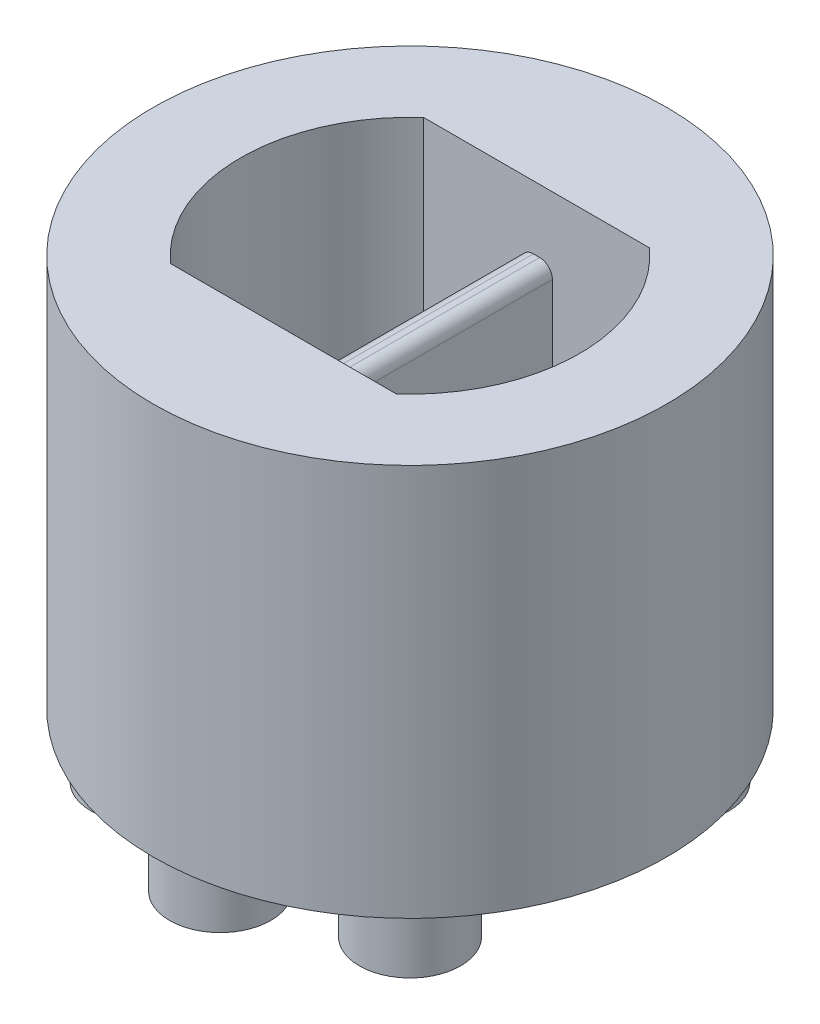
ISO-10303-21;
HEADER;
FILE_DESCRIPTION(('STEP AP214'),'2;1');
FILE_NAME('part.step','',(''),(''),'','','');
FILE_SCHEMA(('AUTOMOTIVE_DESIGN { 1 0 10303 214 1 1 1 1 }'));
ENDSEC;
DATA;
#1=APPLICATION_CONTEXT('core data for automotive mechanical design processes');
#2=APPLICATION_PROTOCOL_DEFINITION('international standard','automotive_design',2000,#1);
#3=PRODUCT_CONTEXT('',#1,'mechanical');
#4=PRODUCT('Part','Part','',(#3));
#5=PRODUCT_RELATED_PRODUCT_CATEGORY('part','',(#4));
#6=PRODUCT_DEFINITION_FORMATION('','',#4);
#7=PRODUCT_DEFINITION_CONTEXT('part definition',#1,'design');
#8=PRODUCT_DEFINITION('design','',#6,#7);
#9=PRODUCT_DEFINITION_SHAPE('','',#8);
#10=(LENGTH_UNIT() NAMED_UNIT(*) SI_UNIT(.MILLI.,.METRE.));
#11=(NAMED_UNIT(*) PLANE_ANGLE_UNIT() SI_UNIT($,.RADIAN.));
#12=(NAMED_UNIT(*) SI_UNIT($,.STERADIAN.) SOLID_ANGLE_UNIT());
#13=UNCERTAINTY_MEASURE_WITH_UNIT(LENGTH_MEASURE(1.E-05),#10,'distance_accuracy_value','');
#14=(GEOMETRIC_REPRESENTATION_CONTEXT(3) GLOBAL_UNCERTAINTY_ASSIGNED_CONTEXT((#13)) GLOBAL_UNIT_ASSIGNED_CONTEXT((#10,
#11,#12)) REPRESENTATION_CONTEXT('',''));
#15=CARTESIAN_POINT('',(0.,0.,0.));
#16=DIRECTION('',(0.,0.,1.));
#17=DIRECTION('',(1.,0.,0.));
#18=AXIS2_PLACEMENT_3D('',#15,#16,#17);
#19=CARTESIAN_POINT('',(0.158749999999999,3.302,-1.27));
#20=DIRECTION('',(0.,-1.,0.));
#21=DIRECTION('',(0.,0.,-1.));
#22=AXIS2_PLACEMENT_3D('',#19,#20,#21);
#23=PLANE('',#22);
#24=DIRECTION('',(0.,0.,1.));
#25=VECTOR('',#24,1.);
#26=CARTESIAN_POINT('',(-0.0317499999999965,3.302,-1.27));
#27=LINE('',#26,#25);
#28=CARTESIAN_POINT('',(-0.0317500000000008,3.302,1.27000000000001));
#29=VERTEX_POINT('',#28);
#30=CARTESIAN_POINT('',(-0.0317500000000002,3.302,-1.27));
#31=VERTEX_POINT('',#30);
#32=EDGE_CURVE('E99',#29,#31,#27,.F.);
#33=ORIENTED_EDGE('',*,*,#32,.F.);
#34=DIRECTION('',(1.,0.,0.));
#35=VECTOR('',#34,1.);
#36=CARTESIAN_POINT('',(0.158749999999999,3.302,1.27000000000001));
#37=LINE('',#36,#35);
#38=CARTESIAN_POINT('',(0.0317499999999965,3.302,1.27000000000001));
#39=VERTEX_POINT('',#38);
#40=EDGE_CURVE('E104',#39,#29,#37,.F.);
#41=ORIENTED_EDGE('',*,*,#40,.F.);
#42=DIRECTION('',(0.,0.,-1.));
#43=VECTOR('',#42,1.);
#44=CARTESIAN_POINT('',(0.0317499999999971,3.302,-1.26999999999999));
#45=LINE('',#44,#43);
#46=CARTESIAN_POINT('',(0.0317499999999971,3.302,-1.27));
#47=VERTEX_POINT('',#46);
#48=EDGE_CURVE('E102',#47,#39,#45,.F.);
#49=ORIENTED_EDGE('',*,*,#48,.F.);
#50=DIRECTION('',(1.,0.,0.));
#51=VECTOR('',#50,1.);
#52=CARTESIAN_POINT('',(0.158749999999999,3.302,-1.27));
#53=LINE('',#52,#51);
#54=EDGE_CURVE('E86',#31,#47,#53,.T.);
#55=ORIENTED_EDGE('',*,*,#54,.F.);
#56=EDGE_LOOP('',(#33,#41,#49,#55));
#57=FACE_BOUND('',#56,.T.);
#58=ADVANCED_FACE('F16',(#57),#23,.F.);
#59=CARTESIAN_POINT('',(-0.031750000000004,3.175,-1.27));
#60=DIRECTION('',(0.,0.,1.));
#61=DIRECTION('',(1.,0.,0.));
#62=AXIS2_PLACEMENT_3D('',#59,#60,#61);
#63=CYLINDRICAL_SURFACE('',#62,0.127);
#64=CARTESIAN_POINT('',(-0.0317500000000046,3.175,1.27));
#65=DIRECTION('',(0.,0.,1.));
#66=DIRECTION('',(1.,0.,0.));
#67=AXIS2_PLACEMENT_3D('',#64,#65,#66);
#68=CIRCLE('',#67,0.127);
#69=CARTESIAN_POINT('',(-0.158749999999999,3.175,1.27000000000001));
#70=VERTEX_POINT('',#69);
#71=EDGE_CURVE('E95',#70,#29,#68,.F.);
#72=ORIENTED_EDGE('',*,*,#71,.T.);
#73=ORIENTED_EDGE('',*,*,#32,.T.);
#74=CARTESIAN_POINT('',(-0.031750000000004,3.175,-1.27));
#75=DIRECTION('',(0.,0.,1.));
#76=DIRECTION('',(1.,0.,0.));
#77=AXIS2_PLACEMENT_3D('',#74,#75,#76);
#78=CIRCLE('',#77,0.127);
#79=CARTESIAN_POINT('',(-0.158749999999999,3.175,-1.27));
#80=VERTEX_POINT('',#79);
#81=EDGE_CURVE('E19',#31,#80,#78,.T.);
#82=ORIENTED_EDGE('',*,*,#81,.T.);
#83=DIRECTION('',(0.,0.,-1.));
#84=VECTOR('',#83,1.);
#85=CARTESIAN_POINT('',(-0.158749999999999,3.175,1.27));
#86=LINE('',#85,#84);
#87=EDGE_CURVE('E181',#80,#70,#86,.F.);
#88=ORIENTED_EDGE('',*,*,#87,.T.);
#89=EDGE_LOOP('',(#72,#73,#82,#88));
#90=FACE_BOUND('',#89,.T.);
#91=ADVANCED_FACE('F106',(#90),#63,.T.);
#92=CARTESIAN_POINT('',(0.0317499999999971,3.175,-1.26999999999999));
#93=DIRECTION('',(0.,0.,-1.));
#94=DIRECTION('',(-1.,0.,0.));
#95=AXIS2_PLACEMENT_3D('',#92,#93,#94);
#96=CYLINDRICAL_SURFACE('',#95,0.127);
#97=CARTESIAN_POINT('',(0.0317499999999971,3.175,-1.27));
#98=DIRECTION('',(0.,0.,-1.));
#99=DIRECTION('',(-1.,0.,0.));
#100=AXIS2_PLACEMENT_3D('',#97,#98,#99);
#101=CIRCLE('',#100,0.127);
#102=CARTESIAN_POINT('',(0.158749999999999,3.175,-1.27));
#103=VERTEX_POINT('',#102);
#104=EDGE_CURVE('E109',#103,#47,#101,.F.);
#105=ORIENTED_EDGE('',*,*,#104,.T.);
#106=ORIENTED_EDGE('',*,*,#48,.T.);
#107=CARTESIAN_POINT('',(0.0317499999999965,3.175,1.27000000000001));
#108=DIRECTION('',(0.,0.,-1.));
#109=DIRECTION('',(-1.,0.,0.));
#110=AXIS2_PLACEMENT_3D('',#107,#108,#109);
#111=CIRCLE('',#110,0.127);
#112=CARTESIAN_POINT('',(0.158749999999999,3.175,1.27000000000001));
#113=VERTEX_POINT('',#112);
#114=EDGE_CURVE('E107',#39,#113,#111,.T.);
#115=ORIENTED_EDGE('',*,*,#114,.T.);
#116=DIRECTION('',(0.,0.,1.));
#117=VECTOR('',#116,1.);
#118=CARTESIAN_POINT('',(0.158749999999999,3.175,1.27));
#119=LINE('',#118,#117);
#120=EDGE_CURVE('E183',#113,#103,#119,.F.);
#121=ORIENTED_EDGE('',*,*,#120,.T.);
#122=EDGE_LOOP('',(#105,#106,#115,#121));
#123=FACE_BOUND('',#122,.T.);
#124=ADVANCED_FACE('F338',(#123),#96,.T.);
#125=CARTESIAN_POINT('',(-0.158749999999999,3.302,1.27));
#126=DIRECTION('',(1.,0.,0.));
#127=DIRECTION('',(0.,0.,-1.));
#128=AXIS2_PLACEMENT_3D('',#125,#126,#127);
#129=PLANE('',#128);
#130=ORIENTED_EDGE('',*,*,#87,.F.);
#131=DIRECTION('',(0.,1.,0.));
#132=VECTOR('',#131,1.);
#133=CARTESIAN_POINT('',(-0.158749999999999,0.508,-1.27));
#134=LINE('',#133,#132);
#135=CARTESIAN_POINT('',(-0.158749999999999,0.508,-1.27));
#136=VERTEX_POINT('',#135);
#137=EDGE_CURVE('E90',#80,#136,#134,.F.);
#138=ORIENTED_EDGE('',*,*,#137,.T.);
#139=DIRECTION('',(0.,0.,1.));
#140=VECTOR('',#139,1.);
#141=CARTESIAN_POINT('',(-0.158749999999999,0.508,0.));
#142=LINE('',#141,#140);
#143=CARTESIAN_POINT('',(-0.158749999999999,0.508,1.27000000000001));
#144=VERTEX_POINT('',#143);
#145=EDGE_CURVE('E178',#144,#136,#142,.F.);
#146=ORIENTED_EDGE('',*,*,#145,.F.);
#147=DIRECTION('',(0.,1.,0.));
#148=VECTOR('',#147,1.);
#149=CARTESIAN_POINT('',(-0.158749999999999,0.508,1.27000000000001));
#150=LINE('',#149,#148);
#151=EDGE_CURVE('E209',#144,#70,#150,.T.);
#152=ORIENTED_EDGE('',*,*,#151,.T.);
#153=EDGE_LOOP('',(#130,#138,#146,#152));
#154=FACE_BOUND('',#153,.T.);
#155=ADVANCED_FACE('F331',(#154),#129,.F.);
#156=CARTESIAN_POINT('',(0.158749999999999,3.302,1.27));
#157=DIRECTION('',(-1.,0.,0.));
#158=DIRECTION('',(0.,0.,1.));
#159=AXIS2_PLACEMENT_3D('',#156,#157,#158);
#160=PLANE('',#159);
#161=ORIENTED_EDGE('',*,*,#120,.F.);
#162=DIRECTION('',(0.,1.,0.));
#163=VECTOR('',#162,1.);
#164=CARTESIAN_POINT('',(0.158749999999999,0.508,1.27000000000001));
#165=LINE('',#164,#163);
#166=CARTESIAN_POINT('',(0.158749999999999,0.508,1.27000000000001));
#167=VERTEX_POINT('',#166);
#168=EDGE_CURVE('E171',#113,#167,#165,.F.);
#169=ORIENTED_EDGE('',*,*,#168,.T.);
#170=DIRECTION('',(0.,0.,1.));
#171=VECTOR('',#170,1.);
#172=CARTESIAN_POINT('',(0.158749999999999,0.508,0.));
#173=LINE('',#172,#171);
#174=CARTESIAN_POINT('',(0.158749999999999,0.508,-1.27));
#175=VERTEX_POINT('',#174);
#176=EDGE_CURVE('E198',#175,#167,#173,.T.);
#177=ORIENTED_EDGE('',*,*,#176,.F.);
#178=DIRECTION('',(0.,1.,0.));
#179=VECTOR('',#178,1.);
#180=CARTESIAN_POINT('',(0.158749999999999,0.508,-1.27));
#181=LINE('',#180,#179);
#182=EDGE_CURVE('E175',#175,#103,#181,.T.);
#183=ORIENTED_EDGE('',*,*,#182,.T.);
#184=EDGE_LOOP('',(#161,#169,#177,#183));
#185=FACE_BOUND('',#184,.T.);
#186=ADVANCED_FACE('F321',(#185),#160,.F.);
#187=CARTESIAN_POINT('',(0.,0.508,0.));
#188=DIRECTION('',(0.,1.,0.));
#189=DIRECTION('',(0.,0.,1.));
#190=AXIS2_PLACEMENT_3D('',#187,#188,#189);
#191=PLANE('',#190);
#192=DIRECTION('',(1.,0.,0.));
#193=VECTOR('',#192,1.);
#194=CARTESIAN_POINT('',(-1.13279443854567,0.508,1.27000000000001));
#195=LINE('',#194,#193);
#196=CARTESIAN_POINT('',(1.13279443854567,0.508,1.27000000000001));
#197=VERTEX_POINT('',#196);
#198=EDGE_CURVE('E214',#167,#197,#195,.T.);
#199=ORIENTED_EDGE('',*,*,#198,.T.);
#200=CARTESIAN_POINT('',(0.,0.508,0.));
#201=DIRECTION('',(0.,1.,0.));
#202=DIRECTION('',(0.,0.,1.));
#203=AXIS2_PLACEMENT_3D('',#200,#201,#202);
#204=CIRCLE('',#203,1.7018);
#205=CARTESIAN_POINT('',(1.13279443854567,0.508,-1.27));
#206=VERTEX_POINT('',#205);
#207=EDGE_CURVE('E172',#197,#206,#204,.T.);
#208=ORIENTED_EDGE('',*,*,#207,.T.);
#209=DIRECTION('',(-1.,0.,0.));
#210=VECTOR('',#209,1.);
#211=CARTESIAN_POINT('',(-1.13279443854567,0.508,-1.27));
#212=LINE('',#211,#210);
#213=EDGE_CURVE('E193',#206,#175,#212,.T.);
#214=ORIENTED_EDGE('',*,*,#213,.T.);
#215=ORIENTED_EDGE('',*,*,#176,.T.);
#216=EDGE_LOOP('',(#199,#208,#214,#215));
#217=FACE_BOUND('',#216,.T.);
#218=CARTESIAN_POINT('',(1.27,0.508,0.));
#219=DIRECTION('',(0.,1.,0.));
#220=DIRECTION('',(0.,0.,1.));
#221=AXIS2_PLACEMENT_3D('',#218,#219,#220);
#222=CIRCLE('',#221,0.3175);
#223=CARTESIAN_POINT('',(1.27,0.508,0.3175));
#224=VERTEX_POINT('',#223);
#225=EDGE_CURVE('E168',#224,#224,#222,.F.);
#226=ORIENTED_EDGE('',*,*,#225,.T.);
#227=EDGE_LOOP('',(#226));
#228=FACE_BOUND('',#227,.T.);
#229=ADVANCED_FACE('F318',(#217,#228),#191,.T.);
#230=CARTESIAN_POINT('',(0.,0.508,0.));
#231=DIRECTION('',(0.,1.,0.));
#232=DIRECTION('',(0.,0.,1.));
#233=AXIS2_PLACEMENT_3D('',#230,#231,#232);
#234=PLANE('',#233);
#235=DIRECTION('',(-1.,0.,0.));
#236=VECTOR('',#235,1.);
#237=CARTESIAN_POINT('',(-1.13279443854567,0.508,-1.27));
#238=LINE('',#237,#236);
#239=CARTESIAN_POINT('',(-1.13279443854567,0.508,-1.27));
#240=VERTEX_POINT('',#239);
#241=EDGE_CURVE('E188',#136,#240,#238,.T.);
#242=ORIENTED_EDGE('',*,*,#241,.T.);
#243=CARTESIAN_POINT('',(0.,0.508,0.));
#244=DIRECTION('',(0.,1.,0.));
#245=DIRECTION('',(0.,0.,1.));
#246=AXIS2_PLACEMENT_3D('',#243,#244,#245);
#247=CIRCLE('',#246,1.7018);
#248=CARTESIAN_POINT('',(-1.13279443854567,0.508,1.27000000000001));
#249=VERTEX_POINT('',#248);
#250=EDGE_CURVE('E176',#240,#249,#247,.T.);
#251=ORIENTED_EDGE('',*,*,#250,.T.);
#252=DIRECTION('',(1.,0.,0.));
#253=VECTOR('',#252,1.);
#254=CARTESIAN_POINT('',(-1.13279443854567,0.508,1.27000000000001));
#255=LINE('',#254,#253);
#256=EDGE_CURVE('E207',#249,#144,#255,.T.);
#257=ORIENTED_EDGE('',*,*,#256,.T.);
#258=ORIENTED_EDGE('',*,*,#145,.T.);
#259=EDGE_LOOP('',(#242,#251,#257,#258));
#260=FACE_BOUND('',#259,.T.);
#261=CARTESIAN_POINT('',(-1.27,0.508,0.));
#262=DIRECTION('',(0.,1.,0.));
#263=DIRECTION('',(0.,0.,1.));
#264=AXIS2_PLACEMENT_3D('',#261,#262,#263);
#265=CIRCLE('',#264,0.3175);
#266=CARTESIAN_POINT('',(-1.27,0.508,0.317500000000007));
#267=VERTEX_POINT('',#266);
#268=EDGE_CURVE('E165',#267,#267,#265,.F.);
#269=ORIENTED_EDGE('',*,*,#268,.T.);
#270=EDGE_LOOP('',(#269));
#271=FACE_BOUND('',#270,.T.);
#272=ADVANCED_FACE('F320',(#260,#271),#234,.T.);
#273=CARTESIAN_POINT('',(-1.34703841816038,-0.635,-1.34703841816036));
#274=DIRECTION('',(0.,-1.,0.));
#275=DIRECTION('',(0.,0.,-1.));
#276=AXIS2_PLACEMENT_3D('',#273,#274,#275);
#277=PLANE('',#276);
#278=CARTESIAN_POINT('',(-1.34703841816038,-0.635,-1.34703841816036));
#279=DIRECTION('',(0.,1.,0.));
#280=DIRECTION('',(0.,0.,1.));
#281=AXIS2_PLACEMENT_3D('',#278,#279,#280);
#282=CIRCLE('',#281,0.508);
#283=CARTESIAN_POINT('',(-1.34703841816038,-0.635,-0.839038418160355));
#284=VERTEX_POINT('',#283);
#285=EDGE_CURVE('E162',#284,#284,#282,.T.);
#286=ORIENTED_EDGE('',*,*,#285,.F.);
#287=EDGE_LOOP('',(#286));
#288=FACE_BOUND('',#287,.T.);
#289=ADVANCED_FACE('F328',(#288),#277,.T.);
#290=CARTESIAN_POINT('',(1.34703841816035,-0.635,-1.34703841816033));
#291=DIRECTION('',(0.,-1.,0.));
#292=DIRECTION('',(0.,0.,-1.));
#293=AXIS2_PLACEMENT_3D('',#290,#291,#292);
#294=PLANE('',#293);
#295=CARTESIAN_POINT('',(1.34703841816035,-0.635,-1.34703841816033));
#296=DIRECTION('',(0.,1.,0.));
#297=DIRECTION('',(0.,0.,1.));
#298=AXIS2_PLACEMENT_3D('',#295,#296,#297);
#299=CIRCLE('',#298,0.508000000000026);
#300=CARTESIAN_POINT('',(1.34703841816035,-0.635,-0.839038418160308));
#301=VERTEX_POINT('',#300);
#302=EDGE_CURVE('E159',#301,#301,#299,.T.);
#303=ORIENTED_EDGE('',*,*,#302,.F.);
#304=EDGE_LOOP('',(#303));
#305=FACE_BOUND('',#304,.T.);
#306=ADVANCED_FACE('F398',(#305),#294,.T.);
#307=CARTESIAN_POINT('',(0.,-0.635,1.905));
#308=DIRECTION('',(0.,-1.,0.));
#309=DIRECTION('',(0.,0.,-1.));
#310=AXIS2_PLACEMENT_3D('',#307,#308,#309);
#311=PLANE('',#310);
#312=CARTESIAN_POINT('',(0.,-0.635,1.905));
#313=DIRECTION('',(0.,1.,0.));
#314=DIRECTION('',(0.,0.,1.));
#315=AXIS2_PLACEMENT_3D('',#312,#313,#314);
#316=CIRCLE('',#315,0.508000000000001);
#317=CARTESIAN_POINT('',(0.,-0.635,2.413));
#318=VERTEX_POINT('',#317);
#319=EDGE_CURVE('E156',#318,#318,#316,.T.);
#320=ORIENTED_EDGE('',*,*,#319,.F.);
#321=EDGE_LOOP('',(#320));
#322=FACE_BOUND('',#321,.T.);
#323=ADVANCED_FACE('F407',(#322),#311,.T.);
#324=CARTESIAN_POINT('',(1.34703841816038,-0.635,1.34703841816037));
#325=DIRECTION('',(0.,-1.,0.));
#326=DIRECTION('',(0.,0.,-1.));
#327=AXIS2_PLACEMENT_3D('',#324,#325,#326);
#328=PLANE('',#327);
#329=CARTESIAN_POINT('',(1.34703841816038,-0.635,1.34703841816037));
#330=DIRECTION('',(0.,1.,0.));
#331=DIRECTION('',(0.,0.,1.));
#332=AXIS2_PLACEMENT_3D('',#329,#330,#331);
#333=CIRCLE('',#332,0.508);
#334=CARTESIAN_POINT('',(1.34703841816038,-0.635,1.85503841816037));
#335=VERTEX_POINT('',#334);
#336=EDGE_CURVE('E153',#335,#335,#333,.T.);
#337=ORIENTED_EDGE('',*,*,#336,.F.);
#338=EDGE_LOOP('',(#337));
#339=FACE_BOUND('',#338,.T.);
#340=ADVANCED_FACE('F417',(#339),#328,.T.);
#341=CARTESIAN_POINT('',(0.,-0.635,-1.90499999999994));
#342=DIRECTION('',(0.,-1.,0.));
#343=DIRECTION('',(0.,0.,-1.));
#344=AXIS2_PLACEMENT_3D('',#341,#342,#343);
#345=PLANE('',#344);
#346=CARTESIAN_POINT('',(0.,-0.635,-1.90499999999994));
#347=DIRECTION('',(0.,1.,0.));
#348=DIRECTION('',(0.,0.,1.));
#349=AXIS2_PLACEMENT_3D('',#346,#347,#348);
#350=CIRCLE('',#349,0.508000000000008);
#351=CARTESIAN_POINT('',(0.,-0.635,-1.39699999999994));
#352=VERTEX_POINT('',#351);
#353=EDGE_CURVE('E150',#352,#352,#350,.T.);
#354=ORIENTED_EDGE('',*,*,#353,.F.);
#355=EDGE_LOOP('',(#354));
#356=FACE_BOUND('',#355,.T.);
#357=ADVANCED_FACE('F427',(#356),#345,.T.);
#358=CARTESIAN_POINT('',(-1.34703841816036,-0.635,1.3470384181604));
#359=DIRECTION('',(0.,-1.,0.));
#360=DIRECTION('',(0.,0.,-1.));
#361=AXIS2_PLACEMENT_3D('',#358,#359,#360);
#362=PLANE('',#361);
#363=CARTESIAN_POINT('',(-1.34703841816036,-0.635,1.3470384181604));
#364=DIRECTION('',(0.,1.,0.));
#365=DIRECTION('',(0.,0.,1.));
#366=AXIS2_PLACEMENT_3D('',#363,#364,#365);
#367=CIRCLE('',#366,0.508000000000001);
#368=CARTESIAN_POINT('',(-1.34703841816036,-0.635,1.8550384181604));
#369=VERTEX_POINT('',#368);
#370=EDGE_CURVE('E147',#369,#369,#367,.T.);
#371=ORIENTED_EDGE('',*,*,#370,.F.);
#372=EDGE_LOOP('',(#371));
#373=FACE_BOUND('',#372,.T.);
#374=ADVANCED_FACE('F437',(#373),#362,.T.);
#375=CARTESIAN_POINT('',(0.,0.508,0.));
#376=DIRECTION('',(0.,1.,0.));
#377=DIRECTION('',(0.,0.,1.));
#378=AXIS2_PLACEMENT_3D('',#375,#376,#377);
#379=CYLINDRICAL_SURFACE('',#378,1.7018);
#380=DIRECTION('',(0.,1.,0.));
#381=VECTOR('',#380,1.);
#382=CARTESIAN_POINT('',(-1.13279443854567,0.508,1.27000000000001));
#383=LINE('',#382,#381);
#384=CARTESIAN_POINT('',(-1.13279443854567,3.937,1.27000000000001));
#385=VERTEX_POINT('',#384);
#386=EDGE_CURVE('E210',#385,#249,#383,.F.);
#387=ORIENTED_EDGE('',*,*,#386,.T.);
#388=ORIENTED_EDGE('',*,*,#250,.F.);
#389=DIRECTION('',(0.,1.,0.));
#390=VECTOR('',#389,1.);
#391=CARTESIAN_POINT('',(-1.13279443854567,0.508,-1.27));
#392=LINE('',#391,#390);
#393=CARTESIAN_POINT('',(-1.13279443854567,3.937,-1.27));
#394=VERTEX_POINT('',#393);
#395=EDGE_CURVE('E190',#240,#394,#392,.T.);
#396=ORIENTED_EDGE('',*,*,#395,.T.);
#397=CARTESIAN_POINT('',(0.,3.937,0.));
#398=DIRECTION('',(0.,1.,0.));
#399=DIRECTION('',(0.,0.,1.));
#400=AXIS2_PLACEMENT_3D('',#397,#398,#399);
#401=CIRCLE('',#400,1.7018);
#402=EDGE_CURVE('E144',#385,#394,#401,.F.);
#403=ORIENTED_EDGE('',*,*,#402,.F.);
#404=EDGE_LOOP('',(#387,#388,#396,#403));
#405=FACE_BOUND('',#404,.T.);
#406=ADVANCED_FACE('F250',(#405),#379,.F.);
#407=CARTESIAN_POINT('',(-1.13279443854567,0.508,-1.27));
#408=DIRECTION('',(0.,0.,-1.));
#409=DIRECTION('',(-1.,0.,0.));
#410=AXIS2_PLACEMENT_3D('',#407,#408,#409);
#411=PLANE('',#410);
#412=ORIENTED_EDGE('',*,*,#104,.F.);
#413=ORIENTED_EDGE('',*,*,#182,.F.);
#414=ORIENTED_EDGE('',*,*,#213,.F.);
#415=DIRECTION('',(0.,1.,0.));
#416=VECTOR('',#415,1.);
#417=CARTESIAN_POINT('',(1.13279443854567,0.508,-1.27));
#418=LINE('',#417,#416);
#419=CARTESIAN_POINT('',(1.13279443854567,3.937,-1.27));
#420=VERTEX_POINT('',#419);
#421=EDGE_CURVE('E174',#206,#420,#418,.T.);
#422=ORIENTED_EDGE('',*,*,#421,.T.);
#423=DIRECTION('',(1.,0.,0.));
#424=VECTOR('',#423,1.);
#425=CARTESIAN_POINT('',(0.,3.937,-1.27));
#426=LINE('',#425,#424);
#427=EDGE_CURVE('E143',#394,#420,#426,.T.);
#428=ORIENTED_EDGE('',*,*,#427,.F.);
#429=ORIENTED_EDGE('',*,*,#395,.F.);
#430=ORIENTED_EDGE('',*,*,#241,.F.);
#431=ORIENTED_EDGE('',*,*,#137,.F.);
#432=ORIENTED_EDGE('',*,*,#81,.F.);
#433=ORIENTED_EDGE('',*,*,#54,.T.);
#434=EDGE_LOOP('',(#412,#413,#414,#422,#428,#429,#430,#431,#432,#433));
#435=FACE_BOUND('',#434,.T.);
#436=ADVANCED_FACE('F85',(#435),#411,.F.);
#437=CARTESIAN_POINT('',(0.,0.508,0.));
#438=DIRECTION('',(0.,1.,0.));
#439=DIRECTION('',(0.,0.,1.));
#440=AXIS2_PLACEMENT_3D('',#437,#438,#439);
#441=CYLINDRICAL_SURFACE('',#440,1.7018);
#442=ORIENTED_EDGE('',*,*,#421,.F.);
#443=ORIENTED_EDGE('',*,*,#207,.F.);
#444=DIRECTION('',(0.,1.,0.));
#445=VECTOR('',#444,1.);
#446=CARTESIAN_POINT('',(1.13279443854567,0.508,1.27000000000001));
#447=LINE('',#446,#445);
#448=CARTESIAN_POINT('',(1.13279443854567,3.937,1.27000000000001));
#449=VERTEX_POINT('',#448);
#450=EDGE_CURVE('E34',#197,#449,#447,.T.);
#451=ORIENTED_EDGE('',*,*,#450,.T.);
#452=CARTESIAN_POINT('',(0.,3.937,0.));
#453=DIRECTION('',(0.,1.,0.));
#454=DIRECTION('',(0.,0.,1.));
#455=AXIS2_PLACEMENT_3D('',#452,#453,#454);
#456=CIRCLE('',#455,1.7018);
#457=EDGE_CURVE('E140',#420,#449,#456,.F.);
#458=ORIENTED_EDGE('',*,*,#457,.F.);
#459=EDGE_LOOP('',(#442,#443,#451,#458));
#460=FACE_BOUND('',#459,.T.);
#461=ADVANCED_FACE('F256',(#460),#441,.F.);
#462=CARTESIAN_POINT('',(-1.13279443854567,0.508,1.27000000000001));
#463=DIRECTION('',(0.,0.,1.));
#464=DIRECTION('',(1.,0.,0.));
#465=AXIS2_PLACEMENT_3D('',#462,#463,#464);
#466=PLANE('',#465);
#467=ORIENTED_EDGE('',*,*,#114,.F.);
#468=ORIENTED_EDGE('',*,*,#40,.T.);
#469=ORIENTED_EDGE('',*,*,#71,.F.);
#470=ORIENTED_EDGE('',*,*,#151,.F.);
#471=ORIENTED_EDGE('',*,*,#256,.F.);
#472=ORIENTED_EDGE('',*,*,#386,.F.);
#473=DIRECTION('',(1.,0.,0.));
#474=VECTOR('',#473,1.);
#475=CARTESIAN_POINT('',(0.,3.937,1.27));
#476=LINE('',#475,#474);
#477=EDGE_CURVE('E139',#449,#385,#476,.F.);
#478=ORIENTED_EDGE('',*,*,#477,.F.);
#479=ORIENTED_EDGE('',*,*,#450,.F.);
#480=ORIENTED_EDGE('',*,*,#198,.F.);
#481=ORIENTED_EDGE('',*,*,#168,.F.);
#482=EDGE_LOOP('',(#467,#468,#469,#470,#471,#472,#478,#479,#480,#481));
#483=FACE_BOUND('',#482,.T.);
#484=ADVANCED_FACE('F244',(#483),#466,.F.);
#485=CARTESIAN_POINT('',(1.27,-0.635,0.));
#486=DIRECTION('',(0.,1.,0.));
#487=DIRECTION('',(0.,0.,1.));
#488=AXIS2_PLACEMENT_3D('',#485,#486,#487);
#489=CYLINDRICAL_SURFACE('',#488,0.3175);
#490=CARTESIAN_POINT('',(1.27,0.,0.));
#491=DIRECTION('',(0.,1.,0.));
#492=DIRECTION('',(0.,0.,1.));
#493=AXIS2_PLACEMENT_3D('',#490,#491,#492);
#494=CIRCLE('',#493,0.3175);
#495=CARTESIAN_POINT('',(1.27,0.,0.3175));
#496=VERTEX_POINT('',#495);
#497=EDGE_CURVE('E136',#496,#496,#494,.F.);
#498=ORIENTED_EDGE('',*,*,#497,.T.);
#499=EDGE_LOOP('',(#498));
#500=FACE_BOUND('',#499,.T.);
#501=ORIENTED_EDGE('',*,*,#225,.F.);
#502=EDGE_LOOP('',(#501));
#503=FACE_BOUND('',#502,.T.);
#504=ADVANCED_FACE('F264',(#500,#503),#489,.F.);
#505=CARTESIAN_POINT('',(-1.27,-0.635,0.));
#506=DIRECTION('',(0.,1.,0.));
#507=DIRECTION('',(0.,0.,1.));
#508=AXIS2_PLACEMENT_3D('',#505,#506,#507);
#509=CYLINDRICAL_SURFACE('',#508,0.3175);
#510=CARTESIAN_POINT('',(-1.27,0.,0.));
#511=DIRECTION('',(0.,1.,0.));
#512=DIRECTION('',(0.,0.,1.));
#513=AXIS2_PLACEMENT_3D('',#510,#511,#512);
#514=CIRCLE('',#513,0.3175);
#515=CARTESIAN_POINT('',(-1.27,0.,0.317500000000007));
#516=VERTEX_POINT('',#515);
#517=EDGE_CURVE('E133',#516,#516,#514,.F.);
#518=ORIENTED_EDGE('',*,*,#517,.T.);
#519=EDGE_LOOP('',(#518));
#520=FACE_BOUND('',#519,.T.);
#521=ORIENTED_EDGE('',*,*,#268,.F.);
#522=EDGE_LOOP('',(#521));
#523=FACE_BOUND('',#522,.T.);
#524=ADVANCED_FACE('F305',(#520,#523),#509,.F.);
#525=CARTESIAN_POINT('',(-1.34703841816038,-0.635,-1.34703841816036));
#526=DIRECTION('',(0.,1.,0.));
#527=DIRECTION('',(0.,0.,1.));
#528=AXIS2_PLACEMENT_3D('',#525,#526,#527);
#529=CYLINDRICAL_SURFACE('',#528,0.508);
#530=ORIENTED_EDGE('',*,*,#285,.T.);
#531=EDGE_LOOP('',(#530));
#532=FACE_BOUND('',#531,.T.);
#533=CARTESIAN_POINT('',(-1.34703841816038,0.,-1.34703841816036));
#534=DIRECTION('',(0.,1.,0.));
#535=DIRECTION('',(0.,0.,1.));
#536=AXIS2_PLACEMENT_3D('',#533,#534,#535);
#537=CIRCLE('',#536,0.508);
#538=CARTESIAN_POINT('',(-1.34703841816038,0.,-0.839038418160355));
#539=VERTEX_POINT('',#538);
#540=EDGE_CURVE('E130',#539,#539,#537,.F.);
#541=ORIENTED_EDGE('',*,*,#540,.T.);
#542=EDGE_LOOP('',(#541));
#543=FACE_BOUND('',#542,.T.);
#544=ADVANCED_FACE('F301',(#532,#543),#529,.T.);
#545=CARTESIAN_POINT('',(1.34703841816035,-0.635,-1.34703841816033));
#546=DIRECTION('',(0.,1.,0.));
#547=DIRECTION('',(0.,0.,1.));
#548=AXIS2_PLACEMENT_3D('',#545,#546,#547);
#549=CYLINDRICAL_SURFACE('',#548,0.508000000000026);
#550=ORIENTED_EDGE('',*,*,#302,.T.);
#551=EDGE_LOOP('',(#550));
#552=FACE_BOUND('',#551,.T.);
#553=CARTESIAN_POINT('',(1.34703841816035,0.,-1.34703841816033));
#554=DIRECTION('',(0.,1.,0.));
#555=DIRECTION('',(0.,0.,1.));
#556=AXIS2_PLACEMENT_3D('',#553,#554,#555);
#557=CIRCLE('',#556,0.508000000000026);
#558=CARTESIAN_POINT('',(1.34703841816035,0.,-0.839038418160308));
#559=VERTEX_POINT('',#558);
#560=EDGE_CURVE('E127',#559,#559,#557,.F.);
#561=ORIENTED_EDGE('',*,*,#560,.T.);
#562=EDGE_LOOP('',(#561));
#563=FACE_BOUND('',#562,.T.);
#564=ADVANCED_FACE('F297',(#552,#563),#549,.T.);
#565=CARTESIAN_POINT('',(0.,-0.635,1.905));
#566=DIRECTION('',(0.,1.,0.));
#567=DIRECTION('',(0.,0.,1.));
#568=AXIS2_PLACEMENT_3D('',#565,#566,#567);
#569=CYLINDRICAL_SURFACE('',#568,0.508000000000001);
#570=ORIENTED_EDGE('',*,*,#319,.T.);
#571=EDGE_LOOP('',(#570));
#572=FACE_BOUND('',#571,.T.);
#573=CARTESIAN_POINT('',(0.,0.,1.905));
#574=DIRECTION('',(0.,1.,0.));
#575=DIRECTION('',(0.,0.,1.));
#576=AXIS2_PLACEMENT_3D('',#573,#574,#575);
#577=CIRCLE('',#576,0.508000000000001);
#578=CARTESIAN_POINT('',(0.,0.,2.413));
#579=VERTEX_POINT('',#578);
#580=EDGE_CURVE('E124',#579,#579,#577,.F.);
#581=ORIENTED_EDGE('',*,*,#580,.T.);
#582=EDGE_LOOP('',(#581));
#583=FACE_BOUND('',#582,.T.);
#584=ADVANCED_FACE('F293',(#572,#583),#569,.T.);
#585=CARTESIAN_POINT('',(1.34703841816038,-0.635,1.34703841816037));
#586=DIRECTION('',(0.,1.,0.));
#587=DIRECTION('',(0.,0.,1.));
#588=AXIS2_PLACEMENT_3D('',#585,#586,#587);
#589=CYLINDRICAL_SURFACE('',#588,0.508);
#590=ORIENTED_EDGE('',*,*,#336,.T.);
#591=EDGE_LOOP('',(#590));
#592=FACE_BOUND('',#591,.T.);
#593=CARTESIAN_POINT('',(1.34703841816038,0.,1.34703841816037));
#594=DIRECTION('',(0.,1.,0.));
#595=DIRECTION('',(0.,0.,1.));
#596=AXIS2_PLACEMENT_3D('',#593,#594,#595);
#597=CIRCLE('',#596,0.508);
#598=CARTESIAN_POINT('',(1.34703841816038,0.,1.85503841816037));
#599=VERTEX_POINT('',#598);
#600=EDGE_CURVE('E121',#599,#599,#597,.F.);
#601=ORIENTED_EDGE('',*,*,#600,.T.);
#602=EDGE_LOOP('',(#601));
#603=FACE_BOUND('',#602,.T.);
#604=ADVANCED_FACE('F289',(#592,#603),#589,.T.);
#605=CARTESIAN_POINT('',(0.,-0.635,-1.90499999999994));
#606=DIRECTION('',(0.,1.,0.));
#607=DIRECTION('',(0.,0.,1.));
#608=AXIS2_PLACEMENT_3D('',#605,#606,#607);
#609=CYLINDRICAL_SURFACE('',#608,0.508000000000008);
#610=ORIENTED_EDGE('',*,*,#353,.T.);
#611=EDGE_LOOP('',(#610));
#612=FACE_BOUND('',#611,.T.);
#613=CARTESIAN_POINT('',(0.,0.,-1.90499999999994));
#614=DIRECTION('',(0.,1.,0.));
#615=DIRECTION('',(0.,0.,1.));
#616=AXIS2_PLACEMENT_3D('',#613,#614,#615);
#617=CIRCLE('',#616,0.508000000000008);
#618=CARTESIAN_POINT('',(0.,0.,-1.39699999999994));
#619=VERTEX_POINT('',#618);
#620=EDGE_CURVE('E118',#619,#619,#617,.F.);
#621=ORIENTED_EDGE('',*,*,#620,.T.);
#622=EDGE_LOOP('',(#621));
#623=FACE_BOUND('',#622,.T.);
#624=ADVANCED_FACE('F285',(#612,#623),#609,.T.);
#625=CARTESIAN_POINT('',(-1.34703841816036,-0.635,1.3470384181604));
#626=DIRECTION('',(0.,1.,0.));
#627=DIRECTION('',(0.,0.,1.));
#628=AXIS2_PLACEMENT_3D('',#625,#626,#627);
#629=CYLINDRICAL_SURFACE('',#628,0.508000000000001);
#630=ORIENTED_EDGE('',*,*,#370,.T.);
#631=EDGE_LOOP('',(#630));
#632=FACE_BOUND('',#631,.T.);
#633=CARTESIAN_POINT('',(-1.34703841816036,0.,1.3470384181604));
#634=DIRECTION('',(0.,1.,0.));
#635=DIRECTION('',(0.,0.,1.));
#636=AXIS2_PLACEMENT_3D('',#633,#634,#635);
#637=CIRCLE('',#636,0.508000000000001);
#638=CARTESIAN_POINT('',(-1.34703841816036,0.,1.8550384181604));
#639=VERTEX_POINT('',#638);
#640=EDGE_CURVE('E115',#639,#639,#637,.F.);
#641=ORIENTED_EDGE('',*,*,#640,.T.);
#642=EDGE_LOOP('',(#641));
#643=FACE_BOUND('',#642,.T.);
#644=ADVANCED_FACE('F281',(#632,#643),#629,.T.);
#645=CARTESIAN_POINT('',(0.,3.937,0.));
#646=DIRECTION('',(0.,1.,0.));
#647=DIRECTION('',(0.,0.,1.));
#648=AXIS2_PLACEMENT_3D('',#645,#646,#647);
#649=PLANE('',#648);
#650=CARTESIAN_POINT('',(0.,3.937,0.));
#651=DIRECTION('',(0.,-1.,0.));
#652=DIRECTION('',(0.,0.,-1.));
#653=AXIS2_PLACEMENT_3D('',#650,#651,#652);
#654=CIRCLE('',#653,2.5781);
#655=CARTESIAN_POINT('',(0.,3.937,-2.5781));
#656=VERTEX_POINT('',#655);
#657=EDGE_CURVE('E25',#656,#656,#654,.T.);
#658=ORIENTED_EDGE('',*,*,#657,.F.);
#659=EDGE_LOOP('',(#658));
#660=FACE_BOUND('',#659,.T.);
#661=ORIENTED_EDGE('',*,*,#457,.T.);
#662=ORIENTED_EDGE('',*,*,#477,.T.);
#663=ORIENTED_EDGE('',*,*,#402,.T.);
#664=ORIENTED_EDGE('',*,*,#427,.T.);
#665=EDGE_LOOP('',(#661,#662,#663,#664));
#666=FACE_BOUND('',#665,.T.);
#667=ADVANCED_FACE('F241',(#660,#666),#649,.T.);
#668=CARTESIAN_POINT('',(0.,0.,0.));
#669=DIRECTION('',(0.,1.,0.));
#670=DIRECTION('',(0.,0.,1.));
#671=AXIS2_PLACEMENT_3D('',#668,#669,#670);
#672=PLANE('',#671);
#673=ORIENTED_EDGE('',*,*,#640,.F.);
#674=EDGE_LOOP('',(#673));
#675=FACE_BOUND('',#674,.T.);
#676=ORIENTED_EDGE('',*,*,#620,.F.);
#677=EDGE_LOOP('',(#676));
#678=FACE_BOUND('',#677,.T.);
#679=ORIENTED_EDGE('',*,*,#600,.F.);
#680=EDGE_LOOP('',(#679));
#681=FACE_BOUND('',#680,.T.);
#682=CARTESIAN_POINT('',(0.,0.,0.));
#683=DIRECTION('',(0.,-1.,0.));
#684=DIRECTION('',(0.,0.,-1.));
#685=AXIS2_PLACEMENT_3D('',#682,#683,#684);
#686=CIRCLE('',#685,2.5781);
#687=CARTESIAN_POINT('',(0.,0.,-2.5781));
#688=VERTEX_POINT('',#687);
#689=EDGE_CURVE('E11',#688,#688,#686,.F.);
#690=ORIENTED_EDGE('',*,*,#689,.F.);
#691=EDGE_LOOP('',(#690));
#692=FACE_BOUND('',#691,.T.);
#693=ORIENTED_EDGE('',*,*,#580,.F.);
#694=EDGE_LOOP('',(#693));
#695=FACE_BOUND('',#694,.T.);
#696=ORIENTED_EDGE('',*,*,#560,.F.);
#697=EDGE_LOOP('',(#696));
#698=FACE_BOUND('',#697,.T.);
#699=ORIENTED_EDGE('',*,*,#540,.F.);
#700=EDGE_LOOP('',(#699));
#701=FACE_BOUND('',#700,.T.);
#702=ORIENTED_EDGE('',*,*,#517,.F.);
#703=EDGE_LOOP('',(#702));
#704=FACE_BOUND('',#703,.T.);
#705=ORIENTED_EDGE('',*,*,#497,.F.);
#706=EDGE_LOOP('',(#705));
#707=FACE_BOUND('',#706,.T.);
#708=ADVANCED_FACE('F269',(#675,#678,#681,#692,#695,#698,#701,#704,#707),#672,.F.);
#709=CARTESIAN_POINT('',(0.,3.937,0.));
#710=DIRECTION('',(0.,-1.,0.));
#711=DIRECTION('',(0.,0.,-1.));
#712=AXIS2_PLACEMENT_3D('',#709,#710,#711);
#713=CYLINDRICAL_SURFACE('',#712,2.5781);
#714=ORIENTED_EDGE('',*,*,#689,.T.);
#715=EDGE_LOOP('',(#714));
#716=FACE_BOUND('',#715,.T.);
#717=ORIENTED_EDGE('',*,*,#657,.T.);
#718=EDGE_LOOP('',(#717));
#719=FACE_BOUND('',#718,.T.);
#720=ADVANCED_FACE('F267',(#716,#719),#713,.T.);
#721=CLOSED_SHELL('',(#58,#91,#124,#155,#186,#229,#272,#289,#306,#323,#340,#357,#374,#406,#436,
#461,#484,#504,#524,#544,#564,#584,#604,#624,#644,#667,#708,#720));
#722=MANIFOLD_SOLID_BREP('B1',#721);
#723=ADVANCED_BREP_SHAPE_REPRESENTATION('',(#18,#722),#14);
#724=SHAPE_DEFINITION_REPRESENTATION(#9,#723);
ENDSEC;
END-ISO-10303-21;
